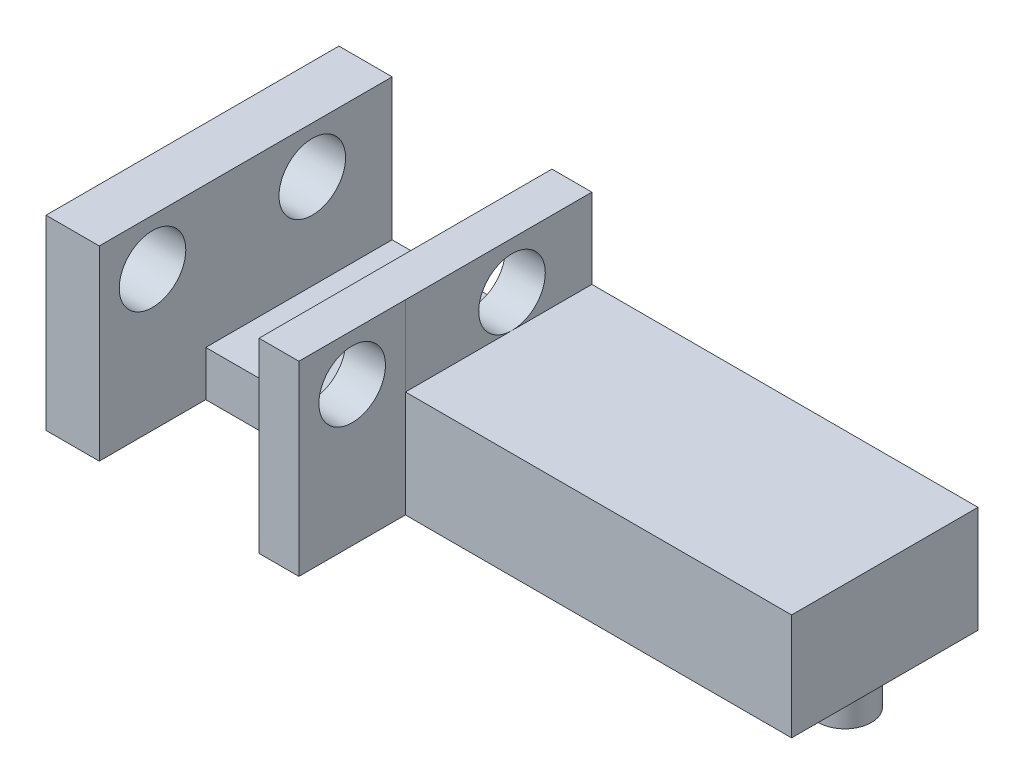
ISO-10303-21;
HEADER;
FILE_DESCRIPTION(('STEP AP214'),'2;1');
FILE_NAME('part.step','',(''),(''),'','','');
FILE_SCHEMA(('AUTOMOTIVE_DESIGN { 1 0 10303 214 1 1 1 1 }'));
ENDSEC;
DATA;
#1=APPLICATION_CONTEXT('core data for automotive mechanical design processes');
#2=APPLICATION_PROTOCOL_DEFINITION('international standard','automotive_design',2000,#1);
#3=PRODUCT_CONTEXT('',#1,'mechanical');
#4=PRODUCT('Part','Part','',(#3));
#5=PRODUCT_RELATED_PRODUCT_CATEGORY('part','',(#4));
#6=PRODUCT_DEFINITION_FORMATION('','',#4);
#7=PRODUCT_DEFINITION_CONTEXT('part definition',#1,'design');
#8=PRODUCT_DEFINITION('design','',#6,#7);
#9=PRODUCT_DEFINITION_SHAPE('','',#8);
#10=(LENGTH_UNIT() NAMED_UNIT(*) SI_UNIT(.MILLI.,.METRE.));
#11=(NAMED_UNIT(*) PLANE_ANGLE_UNIT() SI_UNIT($,.RADIAN.));
#12=(NAMED_UNIT(*) SI_UNIT($,.STERADIAN.) SOLID_ANGLE_UNIT());
#13=UNCERTAINTY_MEASURE_WITH_UNIT(LENGTH_MEASURE(1.E-05),#10,'distance_accuracy_value','');
#14=(GEOMETRIC_REPRESENTATION_CONTEXT(3) GLOBAL_UNCERTAINTY_ASSIGNED_CONTEXT((#13)) GLOBAL_UNIT_ASSIGNED_CONTEXT((#10,
#11,#12)) REPRESENTATION_CONTEXT('',''));
#15=CARTESIAN_POINT('',(0.,0.,0.));
#16=DIRECTION('',(0.,0.,1.));
#17=DIRECTION('',(1.,0.,0.));
#18=AXIS2_PLACEMENT_3D('',#15,#16,#17);
#19=CARTESIAN_POINT('',(0.,0.,3.));
#20=DIRECTION('',(0.,0.,-1.));
#21=DIRECTION('',(-1.,0.,0.));
#22=AXIS2_PLACEMENT_3D('',#19,#20,#21);
#23=PLANE('',#22);
#24=DIRECTION('',(0.,-1.,0.));
#25=VECTOR('',#24,1.);
#26=CARTESIAN_POINT('',(-17.,7.,3.));
#27=LINE('',#26,#25);
#28=CARTESIAN_POINT('',(-17.,1.7,3.));
#29=VERTEX_POINT('',#28);
#30=CARTESIAN_POINT('',(-17.,0.,3.));
#31=VERTEX_POINT('',#30);
#32=EDGE_CURVE('E165',#29,#31,#27,.T.);
#33=ORIENTED_EDGE('',*,*,#32,.F.);
#34=DIRECTION('',(1.,0.,0.));
#35=VECTOR('',#34,1.);
#36=CARTESIAN_POINT('',(0.,1.7,3.));
#37=LINE('',#36,#35);
#38=CARTESIAN_POINT('',(-23.,1.7,3.));
#39=VERTEX_POINT('',#38);
#40=EDGE_CURVE('E213',#39,#29,#37,.T.);
#41=ORIENTED_EDGE('',*,*,#40,.F.);
#42=DIRECTION('',(0.,1.,0.));
#43=VECTOR('',#42,1.);
#44=CARTESIAN_POINT('',(-23.,7.,3.));
#45=LINE('',#44,#43);
#46=CARTESIAN_POINT('',(-23.,0.,3.));
#47=VERTEX_POINT('',#46);
#48=EDGE_CURVE('E166',#47,#39,#45,.T.);
#49=ORIENTED_EDGE('',*,*,#48,.F.);
#50=DIRECTION('',(1.,0.,0.));
#51=VECTOR('',#50,1.);
#52=CARTESIAN_POINT('',(-25.,0.,3.));
#53=LINE('',#52,#51);
#54=EDGE_CURVE('E229',#47,#31,#53,.T.);
#55=ORIENTED_EDGE('',*,*,#54,.T.);
#56=EDGE_LOOP('',(#33,#41,#49,#55));
#57=FACE_BOUND('',#56,.T.);
#58=ADVANCED_FACE('F34',(#57),#23,.F.);
#59=DIRECTION('',(0.,1.,0.));
#60=VECTOR('',#59,1.);
#61=CARTESIAN_POINT('',(-15.5025294120522,7.,3.));
#62=LINE('',#61,#60);
#63=CARTESIAN_POINT('',(-15.5025294120522,0.,3.));
#64=VERTEX_POINT('',#63);
#65=CARTESIAN_POINT('',(-15.5025294120522,7.,3.));
#66=VERTEX_POINT('',#65);
#67=EDGE_CURVE('E161',#64,#66,#62,.T.);
#68=ORIENTED_EDGE('',*,*,#67,.F.);
#69=CARTESIAN_POINT('',(-1.,0.,3.));
#70=VERTEX_POINT('',#69);
#71=EDGE_CURVE('E227',#64,#70,#53,.T.);
#72=ORIENTED_EDGE('',*,*,#71,.T.);
#73=DIRECTION('',(0.,1.,0.));
#74=VECTOR('',#73,1.);
#75=CARTESIAN_POINT('',(-1.,0.,3.));
#76=LINE('',#75,#74);
#77=CARTESIAN_POINT('',(-1.,4.,3.));
#78=VERTEX_POINT('',#77);
#79=EDGE_CURVE('E231',#70,#78,#76,.T.);
#80=ORIENTED_EDGE('',*,*,#79,.T.);
#81=DIRECTION('',(-1.,0.,0.));
#82=VECTOR('',#81,1.);
#83=CARTESIAN_POINT('',(-25.,4.,3.));
#84=LINE('',#83,#82);
#85=CARTESIAN_POINT('',(-15.5,4.,3.));
#86=VERTEX_POINT('',#85);
#87=EDGE_CURVE('E234',#78,#86,#84,.T.);
#88=ORIENTED_EDGE('',*,*,#87,.T.);
#89=DIRECTION('',(0.,-1.,0.));
#90=VECTOR('',#89,1.);
#91=CARTESIAN_POINT('',(-15.5,7.,3.));
#92=LINE('',#91,#90);
#93=CARTESIAN_POINT('',(-15.5,7.,3.));
#94=VERTEX_POINT('',#93);
#95=EDGE_CURVE('E203',#94,#86,#92,.T.);
#96=ORIENTED_EDGE('',*,*,#95,.F.);
#97=DIRECTION('',(1.,0.,0.));
#98=VECTOR('',#97,1.);
#99=CARTESIAN_POINT('',(-17.,7.,3.));
#100=LINE('',#99,#98);
#101=EDGE_CURVE('E190',#66,#94,#100,.T.);
#102=ORIENTED_EDGE('',*,*,#101,.F.);
#103=EDGE_LOOP('',(#68,#72,#80,#88,#96,#102));
#104=FACE_BOUND('',#103,.T.);
#105=ADVANCED_FACE('F289',(#104),#23,.F.);
#106=CARTESIAN_POINT('',(0.,4.,0.));
#107=DIRECTION('',(0.,1.,0.));
#108=DIRECTION('',(0.,0.,1.));
#109=AXIS2_PLACEMENT_3D('',#106,#107,#108);
#110=PLANE('',#109);
#111=DIRECTION('',(1.,0.,0.));
#112=VECTOR('',#111,1.);
#113=CARTESIAN_POINT('',(0.,4.,-4.));
#114=LINE('',#113,#112);
#115=CARTESIAN_POINT('',(-15.5,4.,-4.));
#116=VERTEX_POINT('',#115);
#117=CARTESIAN_POINT('',(-1.,4.,-4.));
#118=VERTEX_POINT('',#117);
#119=EDGE_CURVE('E259',#116,#118,#114,.T.);
#120=ORIENTED_EDGE('',*,*,#119,.F.);
#121=DIRECTION('',(0.,0.,-1.));
#122=VECTOR('',#121,1.);
#123=CARTESIAN_POINT('',(-15.5,4.,3.));
#124=LINE('',#123,#122);
#125=CARTESIAN_POINT('',(-15.5,4.,-1.));
#126=VERTEX_POINT('',#125);
#127=EDGE_CURVE('E187',#126,#116,#124,.T.);
#128=ORIENTED_EDGE('',*,*,#127,.F.);
#129=EDGE_CURVE('E191',#86,#126,#124,.T.);
#130=ORIENTED_EDGE('',*,*,#129,.F.);
#131=ORIENTED_EDGE('',*,*,#87,.F.);
#132=DIRECTION('',(0.,0.,-1.));
#133=VECTOR('',#132,1.);
#134=CARTESIAN_POINT('',(-1.,4.,0.));
#135=LINE('',#134,#133);
#136=EDGE_CURVE('E256',#78,#118,#135,.T.);
#137=ORIENTED_EDGE('',*,*,#136,.T.);
#138=EDGE_LOOP('',(#120,#128,#130,#131,#137));
#139=FACE_BOUND('',#138,.T.);
#140=ADVANCED_FACE('F285',(#139),#110,.T.);
#141=CARTESIAN_POINT('',(0.,4.,-4.));
#142=DIRECTION('',(0.,0.,-1.));
#143=DIRECTION('',(-1.,0.,0.));
#144=AXIS2_PLACEMENT_3D('',#141,#142,#143);
#145=PLANE('',#144);
#146=DIRECTION('',(0.,-1.,0.));
#147=VECTOR('',#146,1.);
#148=CARTESIAN_POINT('',(-25.,4.,-4.));
#149=LINE('',#148,#147);
#150=CARTESIAN_POINT('',(-25.,7.,-4.));
#151=VERTEX_POINT('',#150);
#152=CARTESIAN_POINT('',(-25.,0.,-4.));
#153=VERTEX_POINT('',#152);
#154=EDGE_CURVE('E262',#151,#153,#149,.T.);
#155=ORIENTED_EDGE('',*,*,#154,.F.);
#156=DIRECTION('',(-1.,0.,0.));
#157=VECTOR('',#156,1.);
#158=CARTESIAN_POINT('',(-23.,7.,-4.));
#159=LINE('',#158,#157);
#160=CARTESIAN_POINT('',(-23.,7.,-4.));
#161=VERTEX_POINT('',#160);
#162=EDGE_CURVE('E208',#161,#151,#159,.T.);
#163=ORIENTED_EDGE('',*,*,#162,.F.);
#164=DIRECTION('',(0.,1.,0.));
#165=VECTOR('',#164,1.);
#166=CARTESIAN_POINT('',(-23.,1.7,-4.));
#167=LINE('',#166,#165);
#168=CARTESIAN_POINT('',(-23.,1.7,-4.));
#169=VERTEX_POINT('',#168);
#170=EDGE_CURVE('E225',#169,#161,#167,.T.);
#171=ORIENTED_EDGE('',*,*,#170,.F.);
#172=DIRECTION('',(-1.,0.,0.));
#173=VECTOR('',#172,1.);
#174=CARTESIAN_POINT('',(0.,1.7,-4.));
#175=LINE('',#174,#173);
#176=CARTESIAN_POINT('',(-17.,1.7,-4.));
#177=VERTEX_POINT('',#176);
#178=EDGE_CURVE('E219',#177,#169,#175,.T.);
#179=ORIENTED_EDGE('',*,*,#178,.F.);
#180=DIRECTION('',(0.,1.,0.));
#181=VECTOR('',#180,1.);
#182=CARTESIAN_POINT('',(-17.,1.7,-4.));
#183=LINE('',#182,#181);
#184=CARTESIAN_POINT('',(-17.,7.,-4.));
#185=VERTEX_POINT('',#184);
#186=EDGE_CURVE('E224',#177,#185,#183,.T.);
#187=ORIENTED_EDGE('',*,*,#186,.T.);
#188=DIRECTION('',(-1.,0.,0.));
#189=VECTOR('',#188,1.);
#190=CARTESIAN_POINT('',(-17.,7.,-4.));
#191=LINE('',#190,#189);
#192=CARTESIAN_POINT('',(-15.5,7.,-4.));
#193=VERTEX_POINT('',#192);
#194=EDGE_CURVE('E195',#193,#185,#191,.T.);
#195=ORIENTED_EDGE('',*,*,#194,.F.);
#196=DIRECTION('',(0.,-1.,0.));
#197=VECTOR('',#196,1.);
#198=CARTESIAN_POINT('',(-15.5,7.,-4.));
#199=LINE('',#198,#197);
#200=EDGE_CURVE('E198',#193,#116,#199,.T.);
#201=ORIENTED_EDGE('',*,*,#200,.T.);
#202=ORIENTED_EDGE('',*,*,#119,.T.);
#203=DIRECTION('',(0.,-1.,0.));
#204=VECTOR('',#203,1.);
#205=CARTESIAN_POINT('',(-1.,4.,-4.));
#206=LINE('',#205,#204);
#207=CARTESIAN_POINT('',(-1.,0.,-4.));
#208=VERTEX_POINT('',#207);
#209=EDGE_CURVE('E270',#118,#208,#206,.T.);
#210=ORIENTED_EDGE('',*,*,#209,.T.);
#211=DIRECTION('',(1.,0.,0.));
#212=VECTOR('',#211,1.);
#213=CARTESIAN_POINT('',(0.,0.,-4.));
#214=LINE('',#213,#212);
#215=EDGE_CURVE('E260',#153,#208,#214,.T.);
#216=ORIENTED_EDGE('',*,*,#215,.F.);
#217=EDGE_LOOP('',(#155,#163,#171,#179,#187,#195,#201,#202,#210,#216));
#218=FACE_BOUND('',#217,.T.);
#219=ADVANCED_FACE('F277',(#218),#145,.T.);
#220=CARTESIAN_POINT('',(-18.5,-3.,-2.));
#221=DIRECTION('',(0.,1.,0.));
#222=DIRECTION('',(0.,0.,1.));
#223=AXIS2_PLACEMENT_3D('',#220,#221,#222);
#224=CYLINDRICAL_SURFACE('',#223,1.5);
#225=CARTESIAN_POINT('',(-18.5,-3.,-2.));
#226=DIRECTION('',(0.,1.,0.));
#227=DIRECTION('',(0.,0.,1.));
#228=AXIS2_PLACEMENT_3D('',#225,#226,#227);
#229=CIRCLE('',#228,1.5);
#230=CARTESIAN_POINT('',(-18.5,-3.,-0.500000000000003));
#231=VERTEX_POINT('',#230);
#232=EDGE_CURVE('E11',#231,#231,#229,.T.);
#233=ORIENTED_EDGE('',*,*,#232,.T.);
#234=EDGE_LOOP('',(#233));
#235=FACE_BOUND('',#234,.T.);
#236=CARTESIAN_POINT('',(-18.5,0.,-2.));
#237=DIRECTION('',(0.,1.,0.));
#238=DIRECTION('',(0.,0.,1.));
#239=AXIS2_PLACEMENT_3D('',#236,#237,#238);
#240=CIRCLE('',#239,1.5);
#241=CARTESIAN_POINT('',(-18.5,0.,-0.500000000000003));
#242=VERTEX_POINT('',#241);
#243=EDGE_CURVE('E43',#242,#242,#240,.T.);
#244=ORIENTED_EDGE('',*,*,#243,.F.);
#245=EDGE_LOOP('',(#244));
#246=FACE_BOUND('',#245,.T.);
#247=ADVANCED_FACE('F36',(#235,#246),#224,.T.);
#248=CARTESIAN_POINT('',(0.,-3.,0.));
#249=DIRECTION('',(0.,1.,0.));
#250=DIRECTION('',(0.,0.,1.));
#251=AXIS2_PLACEMENT_3D('',#248,#249,#250);
#252=PLANE('',#251);
#253=ORIENTED_EDGE('',*,*,#232,.F.);
#254=EDGE_LOOP('',(#253));
#255=FACE_BOUND('',#254,.T.);
#256=ADVANCED_FACE('F276',(#255),#252,.F.);
#257=CARTESIAN_POINT('',(-25.,4.,0.));
#258=DIRECTION('',(-1.,0.,0.));
#259=DIRECTION('',(0.,0.,1.));
#260=AXIS2_PLACEMENT_3D('',#257,#258,#259);
#261=PLANE('',#260);
#262=CARTESIAN_POINT('',(-25.,5.25,5.));
#263=DIRECTION('',(1.,0.,0.));
#264=DIRECTION('',(0.,0.,-1.));
#265=AXIS2_PLACEMENT_3D('',#262,#263,#264);
#266=CIRCLE('',#265,1.25);
#267=CARTESIAN_POINT('',(-25.,5.25,3.75));
#268=VERTEX_POINT('',#267);
#269=EDGE_CURVE('E341',#268,#268,#266,.T.);
#270=ORIENTED_EDGE('',*,*,#269,.T.);
#271=EDGE_LOOP('',(#270));
#272=FACE_BOUND('',#271,.T.);
#273=CARTESIAN_POINT('',(-25.,5.25,-1.));
#274=DIRECTION('',(1.,0.,0.));
#275=DIRECTION('',(0.,0.,-1.));
#276=AXIS2_PLACEMENT_3D('',#273,#274,#275);
#277=CIRCLE('',#276,1.25);
#278=CARTESIAN_POINT('',(-25.,5.25,-2.25));
#279=VERTEX_POINT('',#278);
#280=EDGE_CURVE('E345',#279,#279,#277,.T.);
#281=ORIENTED_EDGE('',*,*,#280,.T.);
#282=EDGE_LOOP('',(#281));
#283=FACE_BOUND('',#282,.T.);
#284=DIRECTION('',(0.,0.,-1.));
#285=VECTOR('',#284,1.);
#286=CARTESIAN_POINT('',(-25.,0.,0.));
#287=LINE('',#286,#285);
#288=CARTESIAN_POINT('',(-25.,0.,7.));
#289=VERTEX_POINT('',#288);
#290=EDGE_CURVE('E253',#289,#153,#287,.T.);
#291=ORIENTED_EDGE('',*,*,#290,.F.);
#292=DIRECTION('',(0.,-1.,0.));
#293=VECTOR('',#292,1.);
#294=CARTESIAN_POINT('',(-25.,7.,7.));
#295=LINE('',#294,#293);
#296=CARTESIAN_POINT('',(-25.,7.,7.));
#297=VERTEX_POINT('',#296);
#298=EDGE_CURVE('E169',#297,#289,#295,.T.);
#299=ORIENTED_EDGE('',*,*,#298,.F.);
#300=DIRECTION('',(0.,0.,1.));
#301=VECTOR('',#300,1.);
#302=CARTESIAN_POINT('',(-25.,7.,3.));
#303=LINE('',#302,#301);
#304=EDGE_CURVE('E211',#151,#297,#303,.T.);
#305=ORIENTED_EDGE('',*,*,#304,.F.);
#306=ORIENTED_EDGE('',*,*,#154,.T.);
#307=EDGE_LOOP('',(#291,#299,#305,#306));
#308=FACE_BOUND('',#307,.T.);
#309=ADVANCED_FACE('F283',(#272,#283,#308),#261,.T.);
#310=CARTESIAN_POINT('',(-1.,4.,0.));
#311=DIRECTION('',(-1.,0.,0.));
#312=DIRECTION('',(0.,0.,1.));
#313=AXIS2_PLACEMENT_3D('',#310,#311,#312);
#314=PLANE('',#313);
#315=DIRECTION('',(0.,0.,-1.));
#316=VECTOR('',#315,1.);
#317=CARTESIAN_POINT('',(-1.,0.,0.));
#318=LINE('',#317,#316);
#319=EDGE_CURVE('E264',#70,#208,#318,.T.);
#320=ORIENTED_EDGE('',*,*,#319,.T.);
#321=ORIENTED_EDGE('',*,*,#209,.F.);
#322=ORIENTED_EDGE('',*,*,#136,.F.);
#323=ORIENTED_EDGE('',*,*,#79,.F.);
#324=EDGE_LOOP('',(#320,#321,#322,#323));
#325=FACE_BOUND('',#324,.T.);
#326=ADVANCED_FACE('F328',(#325),#314,.F.);
#327=CARTESIAN_POINT('',(0.,0.,0.));
#328=DIRECTION('',(0.,1.,0.));
#329=DIRECTION('',(0.,0.,1.));
#330=AXIS2_PLACEMENT_3D('',#327,#328,#329);
#331=PLANE('',#330);
#332=CARTESIAN_POINT('',(-4.,0.,-2.));
#333=DIRECTION('',(0.,1.,0.));
#334=DIRECTION('',(0.,0.,1.));
#335=AXIS2_PLACEMENT_3D('',#332,#333,#334);
#336=CIRCLE('',#335,1.);
#337=CARTESIAN_POINT('',(-4.,0.,-1.));
#338=VERTEX_POINT('',#337);
#339=EDGE_CURVE('E237',#338,#338,#336,.T.);
#340=ORIENTED_EDGE('',*,*,#339,.T.);
#341=EDGE_LOOP('',(#340));
#342=FACE_BOUND('',#341,.T.);
#343=CARTESIAN_POINT('',(-14.,0.,-2.));
#344=DIRECTION('',(0.,1.,0.));
#345=DIRECTION('',(0.,0.,1.));
#346=AXIS2_PLACEMENT_3D('',#343,#344,#345);
#347=CIRCLE('',#346,1.);
#348=CARTESIAN_POINT('',(-14.,0.,-0.999999999999999));
#349=VERTEX_POINT('',#348);
#350=EDGE_CURVE('E241',#349,#349,#347,.T.);
#351=ORIENTED_EDGE('',*,*,#350,.T.);
#352=EDGE_LOOP('',(#351));
#353=FACE_BOUND('',#352,.T.);
#354=CARTESIAN_POINT('',(-23.,0.,-2.));
#355=DIRECTION('',(0.,1.,0.));
#356=DIRECTION('',(0.,0.,1.));
#357=AXIS2_PLACEMENT_3D('',#354,#355,#356);
#358=CIRCLE('',#357,1.);
#359=CARTESIAN_POINT('',(-23.,0.,-0.999999999999999));
#360=VERTEX_POINT('',#359);
#361=EDGE_CURVE('E247',#360,#360,#358,.T.);
#362=ORIENTED_EDGE('',*,*,#361,.T.);
#363=EDGE_LOOP('',(#362));
#364=FACE_BOUND('',#363,.T.);
#365=ORIENTED_EDGE('',*,*,#243,.T.);
#366=EDGE_LOOP('',(#365));
#367=FACE_BOUND('',#366,.T.);
#368=ORIENTED_EDGE('',*,*,#290,.T.);
#369=ORIENTED_EDGE('',*,*,#215,.T.);
#370=ORIENTED_EDGE('',*,*,#319,.F.);
#371=ORIENTED_EDGE('',*,*,#71,.F.);
#372=DIRECTION('',(0.,0.,-1.));
#373=VECTOR('',#372,1.);
#374=CARTESIAN_POINT('',(-15.5025294120522,0.,7.));
#375=LINE('',#374,#373);
#376=CARTESIAN_POINT('',(-15.5025294120522,0.,7.));
#377=VERTEX_POINT('',#376);
#378=EDGE_CURVE('E149',#377,#64,#375,.T.);
#379=ORIENTED_EDGE('',*,*,#378,.F.);
#380=DIRECTION('',(1.,0.,0.));
#381=VECTOR('',#380,1.);
#382=CARTESIAN_POINT('',(-17.,0.,7.));
#383=LINE('',#382,#381);
#384=CARTESIAN_POINT('',(-17.,0.,7.));
#385=VERTEX_POINT('',#384);
#386=EDGE_CURVE('E140',#385,#377,#383,.T.);
#387=ORIENTED_EDGE('',*,*,#386,.F.);
#388=DIRECTION('',(0.,0.,-1.));
#389=VECTOR('',#388,1.);
#390=CARTESIAN_POINT('',(-17.,0.,7.));
#391=LINE('',#390,#389);
#392=EDGE_CURVE('E146',#385,#31,#391,.T.);
#393=ORIENTED_EDGE('',*,*,#392,.T.);
#394=ORIENTED_EDGE('',*,*,#54,.F.);
#395=DIRECTION('',(0.,0.,-1.));
#396=VECTOR('',#395,1.);
#397=CARTESIAN_POINT('',(-23.,0.,7.));
#398=LINE('',#397,#396);
#399=CARTESIAN_POINT('',(-23.,0.,7.));
#400=VERTEX_POINT('',#399);
#401=EDGE_CURVE('E183',#400,#47,#398,.T.);
#402=ORIENTED_EDGE('',*,*,#401,.F.);
#403=DIRECTION('',(1.,0.,0.));
#404=VECTOR('',#403,1.);
#405=CARTESIAN_POINT('',(-25.,0.,7.));
#406=LINE('',#405,#404);
#407=EDGE_CURVE('E176',#289,#400,#406,.T.);
#408=ORIENTED_EDGE('',*,*,#407,.F.);
#409=EDGE_LOOP('',(#368,#369,#370,#371,#379,#387,#393,#394,#402,#408));
#410=FACE_BOUND('',#409,.T.);
#411=ADVANCED_FACE('F143',(#342,#353,#364,#367,#410),#331,.F.);
#412=CARTESIAN_POINT('',(-23.,-3.,-2.));
#413=DIRECTION('',(0.,1.,0.));
#414=DIRECTION('',(0.,0.,1.));
#415=AXIS2_PLACEMENT_3D('',#412,#413,#414);
#416=CYLINDRICAL_SURFACE('',#415,1.);
#417=CARTESIAN_POINT('',(-23.,-3.,-2.));
#418=DIRECTION('',(0.,1.,0.));
#419=DIRECTION('',(0.,0.,1.));
#420=AXIS2_PLACEMENT_3D('',#417,#418,#419);
#421=CIRCLE('',#420,1.);
#422=CARTESIAN_POINT('',(-23.,-3.,-0.999999999999999));
#423=VERTEX_POINT('',#422);
#424=EDGE_CURVE('E250',#423,#423,#421,.T.);
#425=ORIENTED_EDGE('',*,*,#424,.T.);
#426=EDGE_LOOP('',(#425));
#427=FACE_BOUND('',#426,.T.);
#428=ORIENTED_EDGE('',*,*,#361,.F.);
#429=EDGE_LOOP('',(#428));
#430=FACE_BOUND('',#429,.T.);
#431=ADVANCED_FACE('F319',(#427,#430),#416,.T.);
#432=CARTESIAN_POINT('',(0.,-3.,0.));
#433=DIRECTION('',(0.,1.,0.));
#434=DIRECTION('',(0.,0.,1.));
#435=AXIS2_PLACEMENT_3D('',#432,#433,#434);
#436=PLANE('',#435);
#437=ORIENTED_EDGE('',*,*,#424,.F.);
#438=EDGE_LOOP('',(#437));
#439=FACE_BOUND('',#438,.T.);
#440=ADVANCED_FACE('F315',(#439),#436,.F.);
#441=CARTESIAN_POINT('',(-14.,-3.,-2.));
#442=DIRECTION('',(0.,1.,0.));
#443=DIRECTION('',(0.,0.,1.));
#444=AXIS2_PLACEMENT_3D('',#441,#442,#443);
#445=CYLINDRICAL_SURFACE('',#444,1.);
#446=CARTESIAN_POINT('',(-14.,-3.,-2.));
#447=DIRECTION('',(0.,1.,0.));
#448=DIRECTION('',(0.,0.,1.));
#449=AXIS2_PLACEMENT_3D('',#446,#447,#448);
#450=CIRCLE('',#449,1.);
#451=CARTESIAN_POINT('',(-14.,-3.,-0.999999999999999));
#452=VERTEX_POINT('',#451);
#453=EDGE_CURVE('E244',#452,#452,#450,.T.);
#454=ORIENTED_EDGE('',*,*,#453,.T.);
#455=EDGE_LOOP('',(#454));
#456=FACE_BOUND('',#455,.T.);
#457=ORIENTED_EDGE('',*,*,#350,.F.);
#458=EDGE_LOOP('',(#457));
#459=FACE_BOUND('',#458,.T.);
#460=ADVANCED_FACE('F311',(#456,#459),#445,.T.);
#461=CARTESIAN_POINT('',(0.,-3.,0.));
#462=DIRECTION('',(0.,1.,0.));
#463=DIRECTION('',(0.,0.,1.));
#464=AXIS2_PLACEMENT_3D('',#461,#462,#463);
#465=PLANE('',#464);
#466=ORIENTED_EDGE('',*,*,#453,.F.);
#467=EDGE_LOOP('',(#466));
#468=FACE_BOUND('',#467,.T.);
#469=ADVANCED_FACE('F307',(#468),#465,.F.);
#470=CARTESIAN_POINT('',(-4.,-3.,-2.));
#471=DIRECTION('',(0.,1.,0.));
#472=DIRECTION('',(0.,0.,1.));
#473=AXIS2_PLACEMENT_3D('',#470,#471,#472);
#474=CYLINDRICAL_SURFACE('',#473,1.);
#475=CARTESIAN_POINT('',(-4.,-3.,-2.));
#476=DIRECTION('',(0.,1.,0.));
#477=DIRECTION('',(0.,0.,1.));
#478=AXIS2_PLACEMENT_3D('',#475,#476,#477);
#479=CIRCLE('',#478,1.);
#480=CARTESIAN_POINT('',(-4.,-3.,-1.));
#481=VERTEX_POINT('',#480);
#482=EDGE_CURVE('E238',#481,#481,#479,.T.);
#483=ORIENTED_EDGE('',*,*,#482,.T.);
#484=EDGE_LOOP('',(#483));
#485=FACE_BOUND('',#484,.T.);
#486=ORIENTED_EDGE('',*,*,#339,.F.);
#487=EDGE_LOOP('',(#486));
#488=FACE_BOUND('',#487,.T.);
#489=ADVANCED_FACE('F303',(#485,#488),#474,.T.);
#490=CARTESIAN_POINT('',(0.,-3.,0.));
#491=DIRECTION('',(0.,1.,0.));
#492=DIRECTION('',(0.,0.,1.));
#493=AXIS2_PLACEMENT_3D('',#490,#491,#492);
#494=PLANE('',#493);
#495=ORIENTED_EDGE('',*,*,#482,.F.);
#496=EDGE_LOOP('',(#495));
#497=FACE_BOUND('',#496,.T.);
#498=ADVANCED_FACE('F299',(#497),#494,.F.);
#499=CARTESIAN_POINT('',(-23.,1.7,0.));
#500=DIRECTION('',(1.,0.,0.));
#501=DIRECTION('',(0.,0.,-1.));
#502=AXIS2_PLACEMENT_3D('',#499,#500,#501);
#503=PLANE('',#502);
#504=CARTESIAN_POINT('',(-23.,5.25,5.));
#505=DIRECTION('',(1.,0.,0.));
#506=DIRECTION('',(0.,0.,-1.));
#507=AXIS2_PLACEMENT_3D('',#504,#505,#506);
#508=CIRCLE('',#507,1.25);
#509=CARTESIAN_POINT('',(-23.,5.25,3.75));
#510=VERTEX_POINT('',#509);
#511=EDGE_CURVE('E425',#510,#510,#508,.T.);
#512=ORIENTED_EDGE('',*,*,#511,.F.);
#513=EDGE_LOOP('',(#512));
#514=FACE_BOUND('',#513,.T.);
#515=CARTESIAN_POINT('',(-23.,5.25,-1.));
#516=DIRECTION('',(1.,0.,0.));
#517=DIRECTION('',(0.,0.,-1.));
#518=AXIS2_PLACEMENT_3D('',#515,#516,#517);
#519=CIRCLE('',#518,1.25);
#520=CARTESIAN_POINT('',(-23.,5.25,-2.25));
#521=VERTEX_POINT('',#520);
#522=EDGE_CURVE('E438',#521,#521,#519,.T.);
#523=ORIENTED_EDGE('',*,*,#522,.F.);
#524=EDGE_LOOP('',(#523));
#525=FACE_BOUND('',#524,.T.);
#526=ORIENTED_EDGE('',*,*,#170,.T.);
#527=DIRECTION('',(0.,0.,-1.));
#528=VECTOR('',#527,1.);
#529=CARTESIAN_POINT('',(-23.,7.,3.));
#530=LINE('',#529,#528);
#531=CARTESIAN_POINT('',(-23.,7.,7.));
#532=VERTEX_POINT('',#531);
#533=EDGE_CURVE('E205',#532,#161,#530,.T.);
#534=ORIENTED_EDGE('',*,*,#533,.F.);
#535=DIRECTION('',(0.,1.,0.));
#536=VECTOR('',#535,1.);
#537=CARTESIAN_POINT('',(-23.,7.,7.));
#538=LINE('',#537,#536);
#539=EDGE_CURVE('E178',#400,#532,#538,.T.);
#540=ORIENTED_EDGE('',*,*,#539,.F.);
#541=ORIENTED_EDGE('',*,*,#401,.T.);
#542=ORIENTED_EDGE('',*,*,#48,.T.);
#543=DIRECTION('',(0.,0.,-1.));
#544=VECTOR('',#543,1.);
#545=CARTESIAN_POINT('',(-23.,1.7,0.));
#546=LINE('',#545,#544);
#547=EDGE_CURVE('E222',#39,#169,#546,.T.);
#548=ORIENTED_EDGE('',*,*,#547,.T.);
#549=EDGE_LOOP('',(#526,#534,#540,#541,#542,#548));
#550=FACE_BOUND('',#549,.T.);
#551=ADVANCED_FACE('F302',(#514,#525,#550),#503,.T.);
#552=CARTESIAN_POINT('',(-17.,1.7,0.));
#553=DIRECTION('',(1.,0.,0.));
#554=DIRECTION('',(0.,0.,-1.));
#555=AXIS2_PLACEMENT_3D('',#552,#553,#554);
#556=PLANE('',#555);
#557=CARTESIAN_POINT('',(-17.,5.25,5.));
#558=DIRECTION('',(1.,0.,0.));
#559=DIRECTION('',(0.,0.,-1.));
#560=AXIS2_PLACEMENT_3D('',#557,#558,#559);
#561=CIRCLE('',#560,1.25);
#562=CARTESIAN_POINT('',(-17.,5.25,3.75));
#563=VERTEX_POINT('',#562);
#564=EDGE_CURVE('E428',#563,#563,#561,.T.);
#565=ORIENTED_EDGE('',*,*,#564,.T.);
#566=EDGE_LOOP('',(#565));
#567=FACE_BOUND('',#566,.T.);
#568=CARTESIAN_POINT('',(-17.,5.25,-1.));
#569=DIRECTION('',(1.,0.,0.));
#570=DIRECTION('',(0.,0.,-1.));
#571=AXIS2_PLACEMENT_3D('',#568,#569,#570);
#572=CIRCLE('',#571,1.25);
#573=CARTESIAN_POINT('',(-17.,5.25,-2.25));
#574=VERTEX_POINT('',#573);
#575=EDGE_CURVE('E435',#574,#574,#572,.T.);
#576=ORIENTED_EDGE('',*,*,#575,.T.);
#577=EDGE_LOOP('',(#576));
#578=FACE_BOUND('',#577,.T.);
#579=DIRECTION('',(0.,0.,-1.));
#580=VECTOR('',#579,1.);
#581=CARTESIAN_POINT('',(-17.,1.7,0.));
#582=LINE('',#581,#580);
#583=EDGE_CURVE('E216',#29,#177,#582,.T.);
#584=ORIENTED_EDGE('',*,*,#583,.F.);
#585=ORIENTED_EDGE('',*,*,#32,.T.);
#586=ORIENTED_EDGE('',*,*,#392,.F.);
#587=DIRECTION('',(0.,-1.,0.));
#588=VECTOR('',#587,1.);
#589=CARTESIAN_POINT('',(-17.,7.,7.));
#590=LINE('',#589,#588);
#591=CARTESIAN_POINT('',(-17.,7.,7.));
#592=VERTEX_POINT('',#591);
#593=EDGE_CURVE('E153',#592,#385,#590,.T.);
#594=ORIENTED_EDGE('',*,*,#593,.F.);
#595=DIRECTION('',(0.,0.,1.));
#596=VECTOR('',#595,1.);
#597=CARTESIAN_POINT('',(-17.,7.,3.));
#598=LINE('',#597,#596);
#599=EDGE_CURVE('E188',#185,#592,#598,.T.);
#600=ORIENTED_EDGE('',*,*,#599,.F.);
#601=ORIENTED_EDGE('',*,*,#186,.F.);
#602=EDGE_LOOP('',(#584,#585,#586,#594,#600,#601));
#603=FACE_BOUND('',#602,.T.);
#604=ADVANCED_FACE('F164',(#567,#578,#603),#556,.F.);
#605=CARTESIAN_POINT('',(0.,1.7,0.));
#606=DIRECTION('',(0.,1.,0.));
#607=DIRECTION('',(0.,0.,1.));
#608=AXIS2_PLACEMENT_3D('',#605,#606,#607);
#609=PLANE('',#608);
#610=ORIENTED_EDGE('',*,*,#40,.T.);
#611=ORIENTED_EDGE('',*,*,#583,.T.);
#612=ORIENTED_EDGE('',*,*,#178,.T.);
#613=ORIENTED_EDGE('',*,*,#547,.F.);
#614=EDGE_LOOP('',(#610,#611,#612,#613));
#615=FACE_BOUND('',#614,.T.);
#616=ADVANCED_FACE('F377',(#615),#609,.T.);
#617=CARTESIAN_POINT('',(0.,7.,0.));
#618=DIRECTION('',(0.,1.,0.));
#619=DIRECTION('',(0.,0.,1.));
#620=AXIS2_PLACEMENT_3D('',#617,#618,#619);
#621=PLANE('',#620);
#622=ORIENTED_EDGE('',*,*,#533,.T.);
#623=ORIENTED_EDGE('',*,*,#162,.T.);
#624=ORIENTED_EDGE('',*,*,#304,.T.);
#625=DIRECTION('',(-1.,0.,0.));
#626=VECTOR('',#625,1.);
#627=CARTESIAN_POINT('',(-25.,7.,7.));
#628=LINE('',#627,#626);
#629=EDGE_CURVE('E181',#532,#297,#628,.T.);
#630=ORIENTED_EDGE('',*,*,#629,.F.);
#631=EDGE_LOOP('',(#622,#623,#624,#630));
#632=FACE_BOUND('',#631,.T.);
#633=ADVANCED_FACE('F356',(#632),#621,.T.);
#634=CARTESIAN_POINT('',(-15.5,7.,3.));
#635=DIRECTION('',(-1.,0.,0.));
#636=DIRECTION('',(0.,0.,1.));
#637=AXIS2_PLACEMENT_3D('',#634,#635,#636);
#638=PLANE('',#637);
#639=ORIENTED_EDGE('',*,*,#129,.T.);
#640=CARTESIAN_POINT('',(-15.5,5.25,-1.));
#641=DIRECTION('',(1.,0.,0.));
#642=DIRECTION('',(0.,0.,-1.));
#643=AXIS2_PLACEMENT_3D('',#640,#641,#642);
#644=CIRCLE('',#643,1.25);
#645=EDGE_CURVE('E49',#126,#126,#644,.T.);
#646=ORIENTED_EDGE('',*,*,#645,.F.);
#647=ORIENTED_EDGE('',*,*,#127,.T.);
#648=ORIENTED_EDGE('',*,*,#200,.F.);
#649=DIRECTION('',(0.,0.,-1.));
#650=VECTOR('',#649,1.);
#651=CARTESIAN_POINT('',(-15.5,7.,3.));
#652=LINE('',#651,#650);
#653=EDGE_CURVE('E193',#94,#193,#652,.T.);
#654=ORIENTED_EDGE('',*,*,#653,.F.);
#655=ORIENTED_EDGE('',*,*,#95,.T.);
#656=EDGE_LOOP('',(#639,#646,#647,#648,#654,#655));
#657=FACE_BOUND('',#656,.T.);
#658=ADVANCED_FACE('F370',(#657),#638,.F.);
#659=CARTESIAN_POINT('',(0.,7.,0.));
#660=DIRECTION('',(0.,-1.,0.));
#661=DIRECTION('',(0.,0.,-1.));
#662=AXIS2_PLACEMENT_3D('',#659,#660,#661);
#663=PLANE('',#662);
#664=ORIENTED_EDGE('',*,*,#599,.T.);
#665=DIRECTION('',(-1.,0.,0.));
#666=VECTOR('',#665,1.);
#667=CARTESIAN_POINT('',(-17.,7.,7.));
#668=LINE('',#667,#666);
#669=CARTESIAN_POINT('',(-15.5025294120522,7.,7.));
#670=VERTEX_POINT('',#669);
#671=EDGE_CURVE('E158',#670,#592,#668,.T.);
#672=ORIENTED_EDGE('',*,*,#671,.F.);
#673=DIRECTION('',(0.,0.,-1.));
#674=VECTOR('',#673,1.);
#675=CARTESIAN_POINT('',(-15.5025294120522,7.,7.));
#676=LINE('',#675,#674);
#677=EDGE_CURVE('E56',#670,#66,#676,.T.);
#678=ORIENTED_EDGE('',*,*,#677,.T.);
#679=ORIENTED_EDGE('',*,*,#101,.T.);
#680=ORIENTED_EDGE('',*,*,#653,.T.);
#681=ORIENTED_EDGE('',*,*,#194,.T.);
#682=EDGE_LOOP('',(#664,#672,#678,#679,#680,#681));
#683=FACE_BOUND('',#682,.T.);
#684=ADVANCED_FACE('F374',(#683),#663,.F.);
#685=CARTESIAN_POINT('',(0.,0.,7.));
#686=DIRECTION('',(0.,0.,1.));
#687=DIRECTION('',(1.,0.,0.));
#688=AXIS2_PLACEMENT_3D('',#685,#686,#687);
#689=PLANE('',#688);
#690=ORIENTED_EDGE('',*,*,#298,.T.);
#691=ORIENTED_EDGE('',*,*,#407,.T.);
#692=ORIENTED_EDGE('',*,*,#539,.T.);
#693=ORIENTED_EDGE('',*,*,#629,.T.);
#694=EDGE_LOOP('',(#690,#691,#692,#693));
#695=FACE_BOUND('',#694,.T.);
#696=ADVANCED_FACE('F353',(#695),#689,.T.);
#697=CARTESIAN_POINT('',(-15.5025294120522,7.,7.));
#698=DIRECTION('',(-1.,0.,0.));
#699=DIRECTION('',(0.,0.,1.));
#700=AXIS2_PLACEMENT_3D('',#697,#698,#699);
#701=PLANE('',#700);
#702=CARTESIAN_POINT('',(-15.5025294120522,5.25,5.));
#703=DIRECTION('',(-1.,0.,0.));
#704=DIRECTION('',(0.,0.,1.));
#705=AXIS2_PLACEMENT_3D('',#702,#703,#704);
#706=CIRCLE('',#705,1.25);
#707=CARTESIAN_POINT('',(-15.5025294120522,5.25,6.25));
#708=VERTEX_POINT('',#707);
#709=EDGE_CURVE('E38',#708,#708,#706,.T.);
#710=ORIENTED_EDGE('',*,*,#709,.T.);
#711=EDGE_LOOP('',(#710));
#712=FACE_BOUND('',#711,.T.);
#713=ORIENTED_EDGE('',*,*,#67,.T.);
#714=ORIENTED_EDGE('',*,*,#677,.F.);
#715=DIRECTION('',(0.,1.,0.));
#716=VECTOR('',#715,1.);
#717=CARTESIAN_POINT('',(-15.5025294120522,7.,7.));
#718=LINE('',#717,#716);
#719=EDGE_CURVE('E152',#377,#670,#718,.T.);
#720=ORIENTED_EDGE('',*,*,#719,.F.);
#721=ORIENTED_EDGE('',*,*,#378,.T.);
#722=EDGE_LOOP('',(#713,#714,#720,#721));
#723=FACE_BOUND('',#722,.T.);
#724=ADVANCED_FACE('F399',(#712,#723),#701,.F.);
#725=CARTESIAN_POINT('',(0.,0.,7.));
#726=DIRECTION('',(0.,0.,1.));
#727=DIRECTION('',(1.,0.,0.));
#728=AXIS2_PLACEMENT_3D('',#725,#726,#727);
#729=PLANE('',#728);
#730=ORIENTED_EDGE('',*,*,#593,.T.);
#731=ORIENTED_EDGE('',*,*,#386,.T.);
#732=ORIENTED_EDGE('',*,*,#719,.T.);
#733=ORIENTED_EDGE('',*,*,#671,.T.);
#734=EDGE_LOOP('',(#730,#731,#732,#733));
#735=FACE_BOUND('',#734,.T.);
#736=ADVANCED_FACE('F157',(#735),#729,.T.);
#737=CARTESIAN_POINT('',(-25.,5.25,5.));
#738=DIRECTION('',(1.,0.,0.));
#739=DIRECTION('',(0.,0.,-1.));
#740=AXIS2_PLACEMENT_3D('',#737,#738,#739);
#741=CYLINDRICAL_SURFACE('',#740,1.25);
#742=ORIENTED_EDGE('',*,*,#709,.F.);
#743=EDGE_LOOP('',(#742));
#744=FACE_BOUND('',#743,.T.);
#745=ORIENTED_EDGE('',*,*,#564,.F.);
#746=EDGE_LOOP('',(#745));
#747=FACE_BOUND('',#746,.T.);
#748=ADVANCED_FACE('F405',(#744,#747),#741,.F.);
#749=CARTESIAN_POINT('',(-25.,5.25,-1.));
#750=DIRECTION('',(1.,0.,0.));
#751=DIRECTION('',(0.,0.,-1.));
#752=AXIS2_PLACEMENT_3D('',#749,#750,#751);
#753=CYLINDRICAL_SURFACE('',#752,1.25);
#754=ORIENTED_EDGE('',*,*,#645,.T.);
#755=EDGE_LOOP('',(#754));
#756=FACE_BOUND('',#755,.T.);
#757=ORIENTED_EDGE('',*,*,#575,.F.);
#758=EDGE_LOOP('',(#757));
#759=FACE_BOUND('',#758,.T.);
#760=ADVANCED_FACE('F410',(#756,#759),#753,.F.);
#761=ORIENTED_EDGE('',*,*,#522,.T.);
#762=EDGE_LOOP('',(#761));
#763=FACE_BOUND('',#762,.T.);
#764=ORIENTED_EDGE('',*,*,#280,.F.);
#765=EDGE_LOOP('',(#764));
#766=FACE_BOUND('',#765,.T.);
#767=ADVANCED_FACE('F406',(#763,#766),#753,.F.);
#768=ORIENTED_EDGE('',*,*,#511,.T.);
#769=EDGE_LOOP('',(#768));
#770=FACE_BOUND('',#769,.T.);
#771=ORIENTED_EDGE('',*,*,#269,.F.);
#772=EDGE_LOOP('',(#771));
#773=FACE_BOUND('',#772,.T.);
#774=ADVANCED_FACE('F409',(#770,#773),#741,.F.);
#775=CLOSED_SHELL('',(#58,#105,#140,#219,#247,#256,#309,#326,#411,#431,#440,#460,#469,#489,#498,
#551,#604,#616,#633,#658,#684,#696,#724,#736,#748,#760,#767,#774));
#776=MANIFOLD_SOLID_BREP('B2',#775);
#777=ADVANCED_BREP_SHAPE_REPRESENTATION('',(#18,#776),#14);
#778=SHAPE_DEFINITION_REPRESENTATION(#9,#777);
ENDSEC;
END-ISO-10303-21;
